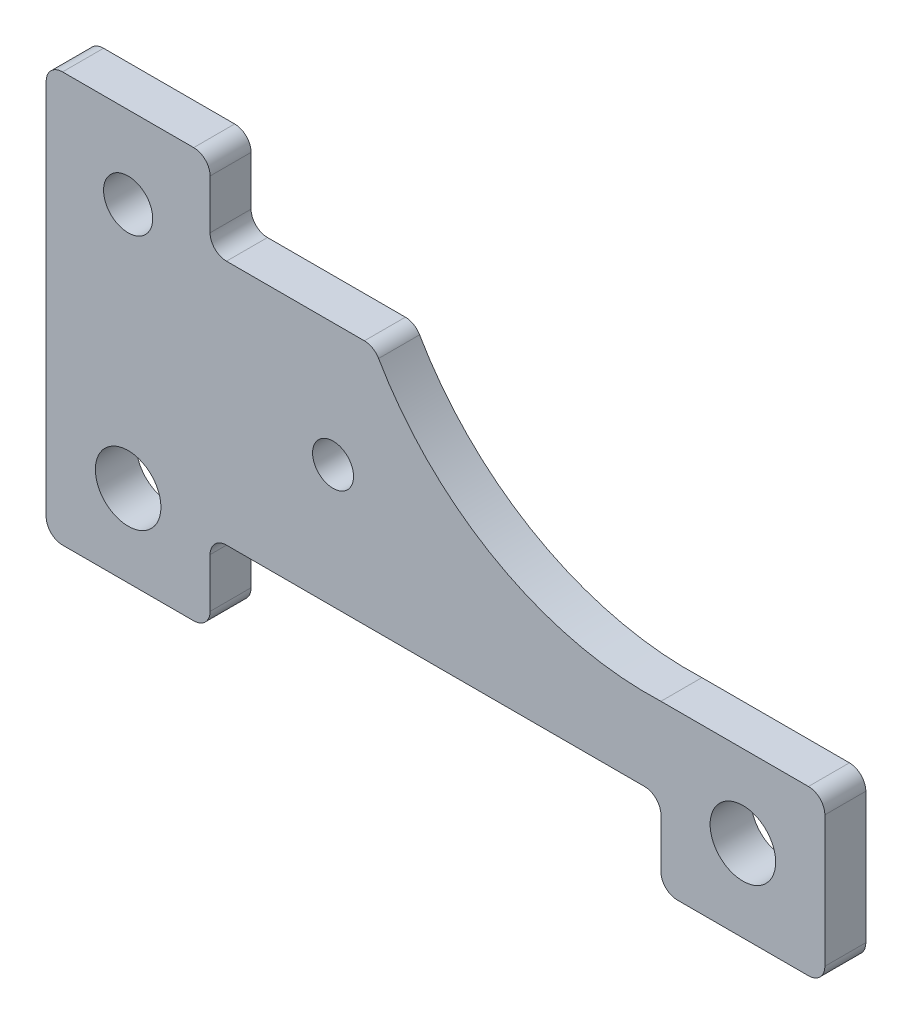
ISO-10303-21;
HEADER;
FILE_DESCRIPTION(('STEP AP214'),'2;1');
FILE_NAME('part.step','',(''),(''),'','','');
FILE_SCHEMA(('AUTOMOTIVE_DESIGN { 1 0 10303 214 1 1 1 1 }'));
ENDSEC;
DATA;
#1=APPLICATION_CONTEXT('core data for automotive mechanical design processes');
#2=APPLICATION_PROTOCOL_DEFINITION('international standard','automotive_design',2000,#1);
#3=PRODUCT_CONTEXT('',#1,'mechanical');
#4=PRODUCT('Part','Part','',(#3));
#5=PRODUCT_RELATED_PRODUCT_CATEGORY('part','',(#4));
#6=PRODUCT_DEFINITION_FORMATION('','',#4);
#7=PRODUCT_DEFINITION_CONTEXT('part definition',#1,'design');
#8=PRODUCT_DEFINITION('design','',#6,#7);
#9=PRODUCT_DEFINITION_SHAPE('','',#8);
#10=(LENGTH_UNIT() NAMED_UNIT(*) SI_UNIT(.MILLI.,.METRE.));
#11=(NAMED_UNIT(*) PLANE_ANGLE_UNIT() SI_UNIT($,.RADIAN.));
#12=(NAMED_UNIT(*) SI_UNIT($,.STERADIAN.) SOLID_ANGLE_UNIT());
#13=UNCERTAINTY_MEASURE_WITH_UNIT(LENGTH_MEASURE(1.E-05),#10,'distance_accuracy_value','');
#14=(GEOMETRIC_REPRESENTATION_CONTEXT(3) GLOBAL_UNCERTAINTY_ASSIGNED_CONTEXT((#13)) GLOBAL_UNIT_ASSIGNED_CONTEXT((#10,
#11,#12)) REPRESENTATION_CONTEXT('',''));
#15=CARTESIAN_POINT('',(0.,0.,0.));
#16=DIRECTION('',(0.,0.,1.));
#17=DIRECTION('',(1.,0.,0.));
#18=AXIS2_PLACEMENT_3D('',#15,#16,#17);
#19=CARTESIAN_POINT('',(180.,20.,25.));
#20=DIRECTION('',(0.,0.,-1.));
#21=DIRECTION('',(-1.,0.,0.));
#22=AXIS2_PLACEMENT_3D('',#19,#20,#21);
#23=PLANE('',#22);
#24=CARTESIAN_POINT('',(180.,20.,25.));
#25=DIRECTION('',(0.,0.,1.));
#26=DIRECTION('',(-1.,0.,0.));
#27=AXIS2_PLACEMENT_3D('',#24,#25,#26);
#28=CIRCLE('',#27,20.);
#29=CARTESIAN_POINT('',(180.,0.,25.));
#30=VERTEX_POINT('',#29);
#31=CARTESIAN_POINT('',(200.,20.,25.));
#32=VERTEX_POINT('',#31);
#33=EDGE_CURVE('E303',#30,#32,#28,.T.);
#34=ORIENTED_EDGE('',*,*,#33,.T.);
#35=DIRECTION('',(0.,1.,0.));
#36=VECTOR('',#35,1.);
#37=CARTESIAN_POINT('',(200.,79.9999999999999,25.));
#38=LINE('',#37,#36);
#39=CARTESIAN_POINT('',(200.,79.9999999999999,25.));
#40=VERTEX_POINT('',#39);
#41=EDGE_CURVE('E149',#32,#40,#38,.T.);
#42=ORIENTED_EDGE('',*,*,#41,.T.);
#43=CARTESIAN_POINT('',(220.,79.9999999999999,25.));
#44=DIRECTION('',(0.,0.,-1.));
#45=DIRECTION('',(1.,0.,0.));
#46=AXIS2_PLACEMENT_3D('',#43,#44,#45);
#47=CIRCLE('',#46,20.);
#48=CARTESIAN_POINT('',(220.,99.9999999999999,25.));
#49=VERTEX_POINT('',#48);
#50=EDGE_CURVE('E384',#40,#49,#47,.T.);
#51=ORIENTED_EDGE('',*,*,#50,.T.);
#52=DIRECTION('',(1.,0.,0.));
#53=VECTOR('',#52,1.);
#54=CARTESIAN_POINT('',(730.,100.,25.));
#55=LINE('',#54,#53);
#56=CARTESIAN_POINT('',(730.,100.,25.));
#57=VERTEX_POINT('',#56);
#58=EDGE_CURVE('E404',#49,#57,#55,.T.);
#59=ORIENTED_EDGE('',*,*,#58,.T.);
#60=CARTESIAN_POINT('',(730.,80.,25.));
#61=DIRECTION('',(0.,0.,-1.));
#62=DIRECTION('',(1.,0.,0.));
#63=AXIS2_PLACEMENT_3D('',#60,#61,#62);
#64=CIRCLE('',#63,19.9999999999999);
#65=CARTESIAN_POINT('',(750.,80.,25.));
#66=VERTEX_POINT('',#65);
#67=EDGE_CURVE('E400',#57,#66,#64,.T.);
#68=ORIENTED_EDGE('',*,*,#67,.T.);
#69=DIRECTION('',(0.,-1.,0.));
#70=VECTOR('',#69,1.);
#71=CARTESIAN_POINT('',(750.,20.0000000000001,25.));
#72=LINE('',#71,#70);
#73=CARTESIAN_POINT('',(750.,20.0000000000001,25.));
#74=VERTEX_POINT('',#73);
#75=EDGE_CURVE('E403',#66,#74,#72,.T.);
#76=ORIENTED_EDGE('',*,*,#75,.T.);
#77=CARTESIAN_POINT('',(770.,20.,25.));
#78=DIRECTION('',(0.,0.,1.));
#79=DIRECTION('',(1.,0.,0.));
#80=AXIS2_PLACEMENT_3D('',#77,#78,#79);
#81=CIRCLE('',#80,20.);
#82=CARTESIAN_POINT('',(770.,0.,25.));
#83=VERTEX_POINT('',#82);
#84=EDGE_CURVE('E408',#74,#83,#81,.T.);
#85=ORIENTED_EDGE('',*,*,#84,.T.);
#86=DIRECTION('',(1.,0.,0.));
#87=VECTOR('',#86,1.);
#88=CARTESIAN_POINT('',(770.,0.,25.));
#89=LINE('',#88,#87);
#90=CARTESIAN_POINT('',(930.,0.,25.));
#91=VERTEX_POINT('',#90);
#92=EDGE_CURVE('E415',#83,#91,#89,.T.);
#93=ORIENTED_EDGE('',*,*,#92,.T.);
#94=CARTESIAN_POINT('',(930.,20.,25.));
#95=DIRECTION('',(0.,0.,1.));
#96=DIRECTION('',(1.,0.,0.));
#97=AXIS2_PLACEMENT_3D('',#94,#95,#96);
#98=CIRCLE('',#97,20.);
#99=CARTESIAN_POINT('',(950.,20.,25.));
#100=VERTEX_POINT('',#99);
#101=EDGE_CURVE('E418',#91,#100,#98,.T.);
#102=ORIENTED_EDGE('',*,*,#101,.T.);
#103=DIRECTION('',(0.,1.,0.));
#104=VECTOR('',#103,1.);
#105=CARTESIAN_POINT('',(950.,20.0000000000001,25.));
#106=LINE('',#105,#104);
#107=CARTESIAN_POINT('',(950.,180.,25.));
#108=VERTEX_POINT('',#107);
#109=EDGE_CURVE('E421',#100,#108,#106,.T.);
#110=ORIENTED_EDGE('',*,*,#109,.T.);
#111=CARTESIAN_POINT('',(930.,180.,25.));
#112=DIRECTION('',(0.,0.,1.));
#113=DIRECTION('',(-1.,0.,0.));
#114=AXIS2_PLACEMENT_3D('',#111,#112,#113);
#115=CIRCLE('',#114,20.);
#116=CARTESIAN_POINT('',(930.,200.,25.));
#117=VERTEX_POINT('',#116);
#118=EDGE_CURVE('E424',#108,#117,#115,.T.);
#119=ORIENTED_EDGE('',*,*,#118,.T.);
#120=DIRECTION('',(-1.,0.,0.));
#121=VECTOR('',#120,1.);
#122=CARTESIAN_POINT('',(750.,200.,25.));
#123=LINE('',#122,#121);
#124=CARTESIAN_POINT('',(750.,200.,25.));
#125=VERTEX_POINT('',#124);
#126=EDGE_CURVE('E427',#117,#125,#123,.T.);
#127=ORIENTED_EDGE('',*,*,#126,.T.);
#128=CARTESIAN_POINT('',(734.826829364207,579.696951387362,25.));
#129=DIRECTION('',(0.,0.,-1.));
#130=DIRECTION('',(1.,0.,0.));
#131=AXIS2_PLACEMENT_3D('',#128,#129,#130);
#132=CIRCLE('',#131,380.);
#133=CARTESIAN_POINT('',(405.571126809262,389.984847569368,25.));
#134=VERTEX_POINT('',#133);
#135=EDGE_CURVE('E430',#125,#134,#132,.T.);
#136=ORIENTED_EDGE('',*,*,#135,.T.);
#137=CARTESIAN_POINT('',(388.24187930637,380.,25.));
#138=DIRECTION('',(0.,0.,1.));
#139=DIRECTION('',(-1.,0.,0.));
#140=AXIS2_PLACEMENT_3D('',#137,#138,#139);
#141=CIRCLE('',#140,20.);
#142=CARTESIAN_POINT('',(388.24187930637,400.,25.));
#143=VERTEX_POINT('',#142);
#144=EDGE_CURVE('E433',#134,#143,#141,.T.);
#145=ORIENTED_EDGE('',*,*,#144,.T.);
#146=DIRECTION('',(-1.,0.,0.));
#147=VECTOR('',#146,1.);
#148=CARTESIAN_POINT('',(220.,400.,25.));
#149=LINE('',#148,#147);
#150=CARTESIAN_POINT('',(220.,400.,25.));
#151=VERTEX_POINT('',#150);
#152=EDGE_CURVE('E436',#143,#151,#149,.T.);
#153=ORIENTED_EDGE('',*,*,#152,.T.);
#154=CARTESIAN_POINT('',(220.,420.,25.));
#155=DIRECTION('',(0.,0.,-1.));
#156=DIRECTION('',(1.,0.,0.));
#157=AXIS2_PLACEMENT_3D('',#154,#155,#156);
#158=CIRCLE('',#157,20.0000000000001);
#159=CARTESIAN_POINT('',(200.,420.,25.));
#160=VERTEX_POINT('',#159);
#161=EDGE_CURVE('E439',#151,#160,#158,.T.);
#162=ORIENTED_EDGE('',*,*,#161,.T.);
#163=DIRECTION('',(0.,1.,0.));
#164=VECTOR('',#163,1.);
#165=CARTESIAN_POINT('',(200.,480.,25.));
#166=LINE('',#165,#164);
#167=CARTESIAN_POINT('',(200.,480.,25.));
#168=VERTEX_POINT('',#167);
#169=EDGE_CURVE('E442',#160,#168,#166,.T.);
#170=ORIENTED_EDGE('',*,*,#169,.T.);
#171=CARTESIAN_POINT('',(180.,480.,25.));
#172=DIRECTION('',(0.,0.,1.));
#173=DIRECTION('',(1.,0.,0.));
#174=AXIS2_PLACEMENT_3D('',#171,#172,#173);
#175=CIRCLE('',#174,19.9999999999999);
#176=CARTESIAN_POINT('',(180.,500.,25.));
#177=VERTEX_POINT('',#176);
#178=EDGE_CURVE('E445',#168,#177,#175,.T.);
#179=ORIENTED_EDGE('',*,*,#178,.T.);
#180=DIRECTION('',(-1.,0.,0.));
#181=VECTOR('',#180,1.);
#182=CARTESIAN_POINT('',(20.0000000000001,500.,25.));
#183=LINE('',#182,#181);
#184=CARTESIAN_POINT('',(20.0000000000001,500.,25.));
#185=VERTEX_POINT('',#184);
#186=EDGE_CURVE('E448',#177,#185,#183,.T.);
#187=ORIENTED_EDGE('',*,*,#186,.T.);
#188=CARTESIAN_POINT('',(20.,480.,25.));
#189=DIRECTION('',(0.,0.,1.));
#190=DIRECTION('',(-1.,0.,0.));
#191=AXIS2_PLACEMENT_3D('',#188,#189,#190);
#192=CIRCLE('',#191,20.);
#193=CARTESIAN_POINT('',(0.,480.,25.));
#194=VERTEX_POINT('',#193);
#195=EDGE_CURVE('E213',#185,#194,#192,.T.);
#196=ORIENTED_EDGE('',*,*,#195,.T.);
#197=DIRECTION('',(0.,-1.,0.));
#198=VECTOR('',#197,1.);
#199=CARTESIAN_POINT('',(0.,20.0000000000001,25.));
#200=LINE('',#199,#198);
#201=CARTESIAN_POINT('',(0.,20.0000000000001,25.));
#202=VERTEX_POINT('',#201);
#203=EDGE_CURVE('E207',#194,#202,#200,.T.);
#204=ORIENTED_EDGE('',*,*,#203,.T.);
#205=CARTESIAN_POINT('',(20.,20.,25.));
#206=DIRECTION('',(0.,0.,1.));
#207=DIRECTION('',(-1.,0.,0.));
#208=AXIS2_PLACEMENT_3D('',#205,#206,#207);
#209=CIRCLE('',#208,20.);
#210=CARTESIAN_POINT('',(20.0000000000001,0.,25.));
#211=VERTEX_POINT('',#210);
#212=EDGE_CURVE('E211',#202,#211,#209,.T.);
#213=ORIENTED_EDGE('',*,*,#212,.T.);
#214=DIRECTION('',(1.,0.,0.));
#215=VECTOR('',#214,1.);
#216=CARTESIAN_POINT('',(20.0000000000001,0.,25.));
#217=LINE('',#216,#215);
#218=EDGE_CURVE('E61',#211,#30,#217,.T.);
#219=ORIENTED_EDGE('',*,*,#218,.T.);
#220=EDGE_LOOP('',(#34,#42,#51,#59,#68,#76,#85,#93,#102,#110,#119,#127,#136,#145,#153,#162,#170,
#179,#187,#196,#204,#213,#219));
#221=FACE_BOUND('',#220,.T.);
#222=CARTESIAN_POINT('',(100.,400.,25.));
#223=DIRECTION('',(0.,0.,1.));
#224=DIRECTION('',(1.,0.,0.));
#225=AXIS2_PLACEMENT_3D('',#222,#223,#224);
#226=CIRCLE('',#225,30.);
#227=CARTESIAN_POINT('',(130.,400.,25.));
#228=VERTEX_POINT('',#227);
#229=EDGE_CURVE('E240',#228,#228,#226,.T.);
#230=ORIENTED_EDGE('',*,*,#229,.F.);
#231=EDGE_LOOP('',(#230));
#232=FACE_BOUND('',#231,.T.);
#233=CARTESIAN_POINT('',(100.,99.9999999999999,25.));
#234=DIRECTION('',(0.,0.,1.));
#235=DIRECTION('',(1.,0.,0.));
#236=AXIS2_PLACEMENT_3D('',#233,#234,#235);
#237=CIRCLE('',#236,40.);
#238=CARTESIAN_POINT('',(140.,99.9999999999999,25.));
#239=VERTEX_POINT('',#238);
#240=EDGE_CURVE('E518',#239,#239,#237,.T.);
#241=ORIENTED_EDGE('',*,*,#240,.F.);
#242=EDGE_LOOP('',(#241));
#243=FACE_BOUND('',#242,.T.);
#244=CARTESIAN_POINT('',(350.,250.,25.));
#245=DIRECTION('',(0.,0.,1.));
#246=DIRECTION('',(1.,0.,0.));
#247=AXIS2_PLACEMENT_3D('',#244,#245,#246);
#248=CIRCLE('',#247,25.);
#249=CARTESIAN_POINT('',(375.,250.,25.));
#250=VERTEX_POINT('',#249);
#251=EDGE_CURVE('E510',#250,#250,#248,.T.);
#252=ORIENTED_EDGE('',*,*,#251,.F.);
#253=EDGE_LOOP('',(#252));
#254=FACE_BOUND('',#253,.T.);
#255=CARTESIAN_POINT('',(850.,100.,25.));
#256=DIRECTION('',(0.,0.,1.));
#257=DIRECTION('',(1.,0.,0.));
#258=AXIS2_PLACEMENT_3D('',#255,#256,#257);
#259=CIRCLE('',#258,40.);
#260=CARTESIAN_POINT('',(890.,100.,25.));
#261=VERTEX_POINT('',#260);
#262=EDGE_CURVE('E499',#261,#261,#259,.T.);
#263=ORIENTED_EDGE('',*,*,#262,.F.);
#264=EDGE_LOOP('',(#263));
#265=FACE_BOUND('',#264,.T.);
#266=ADVANCED_FACE('F43',(#221,#232,#243,#254,#265),#23,.F.);
#267=CARTESIAN_POINT('',(180.,20.,-25.));
#268=DIRECTION('',(0.,0.,-1.));
#269=DIRECTION('',(-1.,0.,0.));
#270=AXIS2_PLACEMENT_3D('',#267,#268,#269);
#271=PLANE('',#270);
#272=CARTESIAN_POINT('',(350.,250.,-25.));
#273=DIRECTION('',(0.,0.,1.));
#274=DIRECTION('',(1.,0.,0.));
#275=AXIS2_PLACEMENT_3D('',#272,#273,#274);
#276=CIRCLE('',#275,25.);
#277=CARTESIAN_POINT('',(375.,250.,-25.));
#278=VERTEX_POINT('',#277);
#279=EDGE_CURVE('E507',#278,#278,#276,.T.);
#280=ORIENTED_EDGE('',*,*,#279,.T.);
#281=EDGE_LOOP('',(#280));
#282=FACE_BOUND('',#281,.T.);
#283=CARTESIAN_POINT('',(100.,400.,-25.));
#284=DIRECTION('',(0.,0.,1.));
#285=DIRECTION('',(1.,0.,0.));
#286=AXIS2_PLACEMENT_3D('',#283,#284,#285);
#287=CIRCLE('',#286,30.);
#288=CARTESIAN_POINT('',(130.,400.,-25.));
#289=VERTEX_POINT('',#288);
#290=EDGE_CURVE('E522',#289,#289,#287,.T.);
#291=ORIENTED_EDGE('',*,*,#290,.T.);
#292=EDGE_LOOP('',(#291));
#293=FACE_BOUND('',#292,.T.);
#294=CARTESIAN_POINT('',(180.,20.,-25.));
#295=DIRECTION('',(0.,0.,1.));
#296=DIRECTION('',(-1.,0.,0.));
#297=AXIS2_PLACEMENT_3D('',#294,#295,#296);
#298=CIRCLE('',#297,20.);
#299=CARTESIAN_POINT('',(180.,0.,-25.));
#300=VERTEX_POINT('',#299);
#301=CARTESIAN_POINT('',(200.,20.,-25.));
#302=VERTEX_POINT('',#301);
#303=EDGE_CURVE('E235',#300,#302,#298,.T.);
#304=ORIENTED_EDGE('',*,*,#303,.F.);
#305=DIRECTION('',(1.,0.,0.));
#306=VECTOR('',#305,1.);
#307=CARTESIAN_POINT('',(20.0000000000001,0.,-25.));
#308=LINE('',#307,#306);
#309=CARTESIAN_POINT('',(20.0000000000001,0.,-25.));
#310=VERTEX_POINT('',#309);
#311=EDGE_CURVE('E141',#310,#300,#308,.T.);
#312=ORIENTED_EDGE('',*,*,#311,.F.);
#313=CARTESIAN_POINT('',(20.,20.,-25.));
#314=DIRECTION('',(0.,0.,1.));
#315=DIRECTION('',(-1.,0.,0.));
#316=AXIS2_PLACEMENT_3D('',#313,#314,#315);
#317=CIRCLE('',#316,20.);
#318=CARTESIAN_POINT('',(0.,20.0000000000001,-25.));
#319=VERTEX_POINT('',#318);
#320=EDGE_CURVE('E135',#319,#310,#317,.T.);
#321=ORIENTED_EDGE('',*,*,#320,.F.);
#322=DIRECTION('',(0.,-1.,0.));
#323=VECTOR('',#322,1.);
#324=CARTESIAN_POINT('',(0.,20.0000000000001,-25.));
#325=LINE('',#324,#323);
#326=CARTESIAN_POINT('',(0.,480.,-25.));
#327=VERTEX_POINT('',#326);
#328=EDGE_CURVE('E222',#327,#319,#325,.T.);
#329=ORIENTED_EDGE('',*,*,#328,.F.);
#330=CARTESIAN_POINT('',(20.,480.,-25.));
#331=DIRECTION('',(0.,0.,1.));
#332=DIRECTION('',(-1.,0.,0.));
#333=AXIS2_PLACEMENT_3D('',#330,#331,#332);
#334=CIRCLE('',#333,20.);
#335=CARTESIAN_POINT('',(20.0000000000001,500.,-25.));
#336=VERTEX_POINT('',#335);
#337=EDGE_CURVE('E294',#336,#327,#334,.T.);
#338=ORIENTED_EDGE('',*,*,#337,.F.);
#339=DIRECTION('',(-1.,0.,0.));
#340=VECTOR('',#339,1.);
#341=CARTESIAN_POINT('',(20.0000000000001,500.,-25.));
#342=LINE('',#341,#340);
#343=CARTESIAN_POINT('',(180.,500.,-25.));
#344=VERTEX_POINT('',#343);
#345=EDGE_CURVE('E291',#344,#336,#342,.T.);
#346=ORIENTED_EDGE('',*,*,#345,.F.);
#347=CARTESIAN_POINT('',(180.,480.,-25.));
#348=DIRECTION('',(0.,0.,1.));
#349=DIRECTION('',(1.,0.,0.));
#350=AXIS2_PLACEMENT_3D('',#347,#348,#349);
#351=CIRCLE('',#350,19.9999999999999);
#352=CARTESIAN_POINT('',(200.,480.,-25.));
#353=VERTEX_POINT('',#352);
#354=EDGE_CURVE('E288',#353,#344,#351,.T.);
#355=ORIENTED_EDGE('',*,*,#354,.F.);
#356=DIRECTION('',(0.,1.,0.));
#357=VECTOR('',#356,1.);
#358=CARTESIAN_POINT('',(200.,480.,-25.));
#359=LINE('',#358,#357);
#360=CARTESIAN_POINT('',(200.,420.,-25.));
#361=VERTEX_POINT('',#360);
#362=EDGE_CURVE('E285',#361,#353,#359,.T.);
#363=ORIENTED_EDGE('',*,*,#362,.F.);
#364=CARTESIAN_POINT('',(220.,420.,-25.));
#365=DIRECTION('',(0.,0.,-1.));
#366=DIRECTION('',(1.,0.,0.));
#367=AXIS2_PLACEMENT_3D('',#364,#365,#366);
#368=CIRCLE('',#367,20.0000000000001);
#369=CARTESIAN_POINT('',(220.,400.,-25.));
#370=VERTEX_POINT('',#369);
#371=EDGE_CURVE('E282',#370,#361,#368,.T.);
#372=ORIENTED_EDGE('',*,*,#371,.F.);
#373=DIRECTION('',(-1.,0.,0.));
#374=VECTOR('',#373,1.);
#375=CARTESIAN_POINT('',(220.,400.,-25.));
#376=LINE('',#375,#374);
#377=CARTESIAN_POINT('',(388.24187930637,400.,-25.));
#378=VERTEX_POINT('',#377);
#379=EDGE_CURVE('E279',#378,#370,#376,.T.);
#380=ORIENTED_EDGE('',*,*,#379,.F.);
#381=CARTESIAN_POINT('',(388.24187930637,380.,-25.));
#382=DIRECTION('',(0.,0.,1.));
#383=DIRECTION('',(-1.,0.,0.));
#384=AXIS2_PLACEMENT_3D('',#381,#382,#383);
#385=CIRCLE('',#384,20.);
#386=CARTESIAN_POINT('',(405.571126809262,389.984847569368,-25.));
#387=VERTEX_POINT('',#386);
#388=EDGE_CURVE('E276',#387,#378,#385,.T.);
#389=ORIENTED_EDGE('',*,*,#388,.F.);
#390=CARTESIAN_POINT('',(734.826829364207,579.696951387362,-25.));
#391=DIRECTION('',(0.,0.,-1.));
#392=DIRECTION('',(1.,0.,0.));
#393=AXIS2_PLACEMENT_3D('',#390,#391,#392);
#394=CIRCLE('',#393,380.);
#395=CARTESIAN_POINT('',(750.,200.,-25.));
#396=VERTEX_POINT('',#395);
#397=EDGE_CURVE('E273',#396,#387,#394,.T.);
#398=ORIENTED_EDGE('',*,*,#397,.F.);
#399=DIRECTION('',(-1.,0.,0.));
#400=VECTOR('',#399,1.);
#401=CARTESIAN_POINT('',(750.,200.,-25.));
#402=LINE('',#401,#400);
#403=CARTESIAN_POINT('',(930.,200.,-25.));
#404=VERTEX_POINT('',#403);
#405=EDGE_CURVE('E270',#404,#396,#402,.T.);
#406=ORIENTED_EDGE('',*,*,#405,.F.);
#407=CARTESIAN_POINT('',(930.,180.,-25.));
#408=DIRECTION('',(0.,0.,1.));
#409=DIRECTION('',(-1.,0.,0.));
#410=AXIS2_PLACEMENT_3D('',#407,#408,#409);
#411=CIRCLE('',#410,20.);
#412=CARTESIAN_POINT('',(950.,180.,-25.));
#413=VERTEX_POINT('',#412);
#414=EDGE_CURVE('E267',#413,#404,#411,.T.);
#415=ORIENTED_EDGE('',*,*,#414,.F.);
#416=DIRECTION('',(0.,1.,0.));
#417=VECTOR('',#416,1.);
#418=CARTESIAN_POINT('',(950.,20.0000000000001,-25.));
#419=LINE('',#418,#417);
#420=CARTESIAN_POINT('',(950.,20.,-25.));
#421=VERTEX_POINT('',#420);
#422=EDGE_CURVE('E264',#421,#413,#419,.T.);
#423=ORIENTED_EDGE('',*,*,#422,.F.);
#424=CARTESIAN_POINT('',(930.,20.,-25.));
#425=DIRECTION('',(0.,0.,1.));
#426=DIRECTION('',(1.,0.,0.));
#427=AXIS2_PLACEMENT_3D('',#424,#425,#426);
#428=CIRCLE('',#427,20.);
#429=CARTESIAN_POINT('',(930.,0.,-25.));
#430=VERTEX_POINT('',#429);
#431=EDGE_CURVE('E261',#430,#421,#428,.T.);
#432=ORIENTED_EDGE('',*,*,#431,.F.);
#433=DIRECTION('',(1.,0.,0.));
#434=VECTOR('',#433,1.);
#435=CARTESIAN_POINT('',(770.,0.,-25.));
#436=LINE('',#435,#434);
#437=CARTESIAN_POINT('',(770.,0.,-25.));
#438=VERTEX_POINT('',#437);
#439=EDGE_CURVE('E258',#438,#430,#436,.T.);
#440=ORIENTED_EDGE('',*,*,#439,.F.);
#441=CARTESIAN_POINT('',(770.,20.,-25.));
#442=DIRECTION('',(0.,0.,1.));
#443=DIRECTION('',(1.,0.,0.));
#444=AXIS2_PLACEMENT_3D('',#441,#442,#443);
#445=CIRCLE('',#444,20.);
#446=CARTESIAN_POINT('',(750.,20.0000000000001,-25.));
#447=VERTEX_POINT('',#446);
#448=EDGE_CURVE('E255',#447,#438,#445,.T.);
#449=ORIENTED_EDGE('',*,*,#448,.F.);
#450=DIRECTION('',(0.,-1.,0.));
#451=VECTOR('',#450,1.);
#452=CARTESIAN_POINT('',(750.,20.0000000000001,-25.));
#453=LINE('',#452,#451);
#454=CARTESIAN_POINT('',(750.,80.,-25.));
#455=VERTEX_POINT('',#454);
#456=EDGE_CURVE('E252',#455,#447,#453,.T.);
#457=ORIENTED_EDGE('',*,*,#456,.F.);
#458=CARTESIAN_POINT('',(730.,80.,-25.));
#459=DIRECTION('',(0.,0.,-1.));
#460=DIRECTION('',(1.,0.,0.));
#461=AXIS2_PLACEMENT_3D('',#458,#459,#460);
#462=CIRCLE('',#461,19.9999999999999);
#463=CARTESIAN_POINT('',(730.,100.,-25.));
#464=VERTEX_POINT('',#463);
#465=EDGE_CURVE('E249',#464,#455,#462,.T.);
#466=ORIENTED_EDGE('',*,*,#465,.F.);
#467=DIRECTION('',(1.,0.,0.));
#468=VECTOR('',#467,1.);
#469=CARTESIAN_POINT('',(730.,100.,-25.));
#470=LINE('',#469,#468);
#471=CARTESIAN_POINT('',(220.,99.9999999999999,-25.));
#472=VERTEX_POINT('',#471);
#473=EDGE_CURVE('E246',#472,#464,#470,.T.);
#474=ORIENTED_EDGE('',*,*,#473,.F.);
#475=CARTESIAN_POINT('',(220.,79.9999999999999,-25.));
#476=DIRECTION('',(0.,0.,-1.));
#477=DIRECTION('',(1.,0.,0.));
#478=AXIS2_PLACEMENT_3D('',#475,#476,#477);
#479=CIRCLE('',#478,20.);
#480=CARTESIAN_POINT('',(200.,79.9999999999999,-25.));
#481=VERTEX_POINT('',#480);
#482=EDGE_CURVE('E243',#481,#472,#479,.T.);
#483=ORIENTED_EDGE('',*,*,#482,.F.);
#484=DIRECTION('',(0.,1.,0.));
#485=VECTOR('',#484,1.);
#486=CARTESIAN_POINT('',(200.,79.9999999999999,-25.));
#487=LINE('',#486,#485);
#488=EDGE_CURVE('E239',#302,#481,#487,.T.);
#489=ORIENTED_EDGE('',*,*,#488,.F.);
#490=EDGE_LOOP('',(#304,#312,#321,#329,#338,#346,#355,#363,#372,#380,#389,#398,#406,#415,#423,
#432,#440,#449,#457,#466,#474,#483,#489));
#491=FACE_BOUND('',#490,.T.);
#492=CARTESIAN_POINT('',(100.,99.9999999999999,-25.));
#493=DIRECTION('',(0.,0.,1.));
#494=DIRECTION('',(1.,0.,0.));
#495=AXIS2_PLACEMENT_3D('',#492,#493,#494);
#496=CIRCLE('',#495,40.);
#497=CARTESIAN_POINT('',(140.,99.9999999999999,-25.));
#498=VERTEX_POINT('',#497);
#499=EDGE_CURVE('E514',#498,#498,#496,.T.);
#500=ORIENTED_EDGE('',*,*,#499,.T.);
#501=EDGE_LOOP('',(#500));
#502=FACE_BOUND('',#501,.T.);
#503=CARTESIAN_POINT('',(850.,100.,-25.));
#504=DIRECTION('',(0.,0.,1.));
#505=DIRECTION('',(1.,0.,0.));
#506=AXIS2_PLACEMENT_3D('',#503,#504,#505);
#507=CIRCLE('',#506,40.);
#508=CARTESIAN_POINT('',(890.,100.,-25.));
#509=VERTEX_POINT('',#508);
#510=EDGE_CURVE('E502',#509,#509,#507,.T.);
#511=ORIENTED_EDGE('',*,*,#510,.T.);
#512=EDGE_LOOP('',(#511));
#513=FACE_BOUND('',#512,.T.);
#514=ADVANCED_FACE('F388',(#282,#293,#491,#502,#513),#271,.T.);
#515=CARTESIAN_POINT('',(180.,20.,25.));
#516=DIRECTION('',(0.,0.,-1.));
#517=DIRECTION('',(-1.,0.,0.));
#518=AXIS2_PLACEMENT_3D('',#515,#516,#517);
#519=CYLINDRICAL_SURFACE('',#518,20.);
#520=ORIENTED_EDGE('',*,*,#303,.T.);
#521=DIRECTION('',(0.,0.,-1.));
#522=VECTOR('',#521,1.);
#523=CARTESIAN_POINT('',(200.,20.,25.));
#524=LINE('',#523,#522);
#525=EDGE_CURVE('E11',#32,#302,#524,.T.);
#526=ORIENTED_EDGE('',*,*,#525,.F.);
#527=ORIENTED_EDGE('',*,*,#33,.F.);
#528=DIRECTION('',(0.,0.,-1.));
#529=VECTOR('',#528,1.);
#530=CARTESIAN_POINT('',(180.,0.,25.));
#531=LINE('',#530,#529);
#532=EDGE_CURVE('E231',#30,#300,#531,.T.);
#533=ORIENTED_EDGE('',*,*,#532,.T.);
#534=EDGE_LOOP('',(#520,#526,#527,#533));
#535=FACE_BOUND('',#534,.T.);
#536=ADVANCED_FACE('F45',(#535),#519,.T.);
#537=CARTESIAN_POINT('',(200.,79.9999999999999,25.));
#538=DIRECTION('',(-1.,0.,0.));
#539=DIRECTION('',(0.,-1.,0.));
#540=AXIS2_PLACEMENT_3D('',#537,#538,#539);
#541=PLANE('',#540);
#542=ORIENTED_EDGE('',*,*,#488,.T.);
#543=DIRECTION('',(0.,0.,-1.));
#544=VECTOR('',#543,1.);
#545=CARTESIAN_POINT('',(200.,79.9999999999999,25.));
#546=LINE('',#545,#544);
#547=EDGE_CURVE('E53',#40,#481,#546,.T.);
#548=ORIENTED_EDGE('',*,*,#547,.F.);
#549=ORIENTED_EDGE('',*,*,#41,.F.);
#550=ORIENTED_EDGE('',*,*,#525,.T.);
#551=EDGE_LOOP('',(#542,#548,#549,#550));
#552=FACE_BOUND('',#551,.T.);
#553=ADVANCED_FACE('F771',(#552),#541,.F.);
#554=CARTESIAN_POINT('',(220.,79.9999999999999,25.));
#555=DIRECTION('',(0.,0.,-1.));
#556=DIRECTION('',(-1.,0.,0.));
#557=AXIS2_PLACEMENT_3D('',#554,#555,#556);
#558=CYLINDRICAL_SURFACE('',#557,20.);
#559=ORIENTED_EDGE('',*,*,#482,.T.);
#560=DIRECTION('',(0.,0.,-1.));
#561=VECTOR('',#560,1.);
#562=CARTESIAN_POINT('',(220.,99.9999999999999,25.));
#563=LINE('',#562,#561);
#564=EDGE_CURVE('E374',#49,#472,#563,.T.);
#565=ORIENTED_EDGE('',*,*,#564,.F.);
#566=ORIENTED_EDGE('',*,*,#50,.F.);
#567=ORIENTED_EDGE('',*,*,#547,.T.);
#568=EDGE_LOOP('',(#559,#565,#566,#567));
#569=FACE_BOUND('',#568,.T.);
#570=ADVANCED_FACE('F382',(#569),#558,.F.);
#571=CARTESIAN_POINT('',(730.,100.,25.));
#572=DIRECTION('',(0.,1.,0.));
#573=DIRECTION('',(-1.,0.,0.));
#574=AXIS2_PLACEMENT_3D('',#571,#572,#573);
#575=PLANE('',#574);
#576=ORIENTED_EDGE('',*,*,#473,.T.);
#577=DIRECTION('',(0.,0.,-1.));
#578=VECTOR('',#577,1.);
#579=CARTESIAN_POINT('',(730.,100.,25.));
#580=LINE('',#579,#578);
#581=EDGE_CURVE('E370',#57,#464,#580,.T.);
#582=ORIENTED_EDGE('',*,*,#581,.F.);
#583=ORIENTED_EDGE('',*,*,#58,.F.);
#584=ORIENTED_EDGE('',*,*,#564,.T.);
#585=EDGE_LOOP('',(#576,#582,#583,#584));
#586=FACE_BOUND('',#585,.T.);
#587=ADVANCED_FACE('F394',(#586),#575,.F.);
#588=CARTESIAN_POINT('',(730.,80.,25.));
#589=DIRECTION('',(0.,0.,-1.));
#590=DIRECTION('',(-1.,0.,0.));
#591=AXIS2_PLACEMENT_3D('',#588,#589,#590);
#592=CYLINDRICAL_SURFACE('',#591,19.9999999999999);
#593=ORIENTED_EDGE('',*,*,#465,.T.);
#594=DIRECTION('',(0.,0.,-1.));
#595=VECTOR('',#594,1.);
#596=CARTESIAN_POINT('',(750.,80.,25.));
#597=LINE('',#596,#595);
#598=EDGE_CURVE('E366',#66,#455,#597,.T.);
#599=ORIENTED_EDGE('',*,*,#598,.F.);
#600=ORIENTED_EDGE('',*,*,#67,.F.);
#601=ORIENTED_EDGE('',*,*,#581,.T.);
#602=EDGE_LOOP('',(#593,#599,#600,#601));
#603=FACE_BOUND('',#602,.T.);
#604=ADVANCED_FACE('F398',(#603),#592,.F.);
#605=CARTESIAN_POINT('',(750.,20.0000000000001,25.));
#606=DIRECTION('',(1.,0.,0.));
#607=DIRECTION('',(0.,1.,0.));
#608=AXIS2_PLACEMENT_3D('',#605,#606,#607);
#609=PLANE('',#608);
#610=ORIENTED_EDGE('',*,*,#456,.T.);
#611=DIRECTION('',(0.,0.,-1.));
#612=VECTOR('',#611,1.);
#613=CARTESIAN_POINT('',(750.,20.0000000000001,25.));
#614=LINE('',#613,#612);
#615=EDGE_CURVE('E362',#74,#447,#614,.T.);
#616=ORIENTED_EDGE('',*,*,#615,.F.);
#617=ORIENTED_EDGE('',*,*,#75,.F.);
#618=ORIENTED_EDGE('',*,*,#598,.T.);
#619=EDGE_LOOP('',(#610,#616,#617,#618));
#620=FACE_BOUND('',#619,.T.);
#621=ADVANCED_FACE('F732',(#620),#609,.F.);
#622=CARTESIAN_POINT('',(770.,20.,25.));
#623=DIRECTION('',(0.,0.,-1.));
#624=DIRECTION('',(-1.,0.,0.));
#625=AXIS2_PLACEMENT_3D('',#622,#623,#624);
#626=CYLINDRICAL_SURFACE('',#625,20.);
#627=ORIENTED_EDGE('',*,*,#448,.T.);
#628=DIRECTION('',(0.,0.,-1.));
#629=VECTOR('',#628,1.);
#630=CARTESIAN_POINT('',(770.,0.,25.));
#631=LINE('',#630,#629);
#632=EDGE_CURVE('E358',#83,#438,#631,.T.);
#633=ORIENTED_EDGE('',*,*,#632,.F.);
#634=ORIENTED_EDGE('',*,*,#84,.F.);
#635=ORIENTED_EDGE('',*,*,#615,.T.);
#636=EDGE_LOOP('',(#627,#633,#634,#635));
#637=FACE_BOUND('',#636,.T.);
#638=ADVANCED_FACE('F721',(#637),#626,.T.);
#639=CARTESIAN_POINT('',(770.,0.,25.));
#640=DIRECTION('',(0.,1.,0.));
#641=DIRECTION('',(0.,0.,1.));
#642=AXIS2_PLACEMENT_3D('',#639,#640,#641);
#643=PLANE('',#642);
#644=ORIENTED_EDGE('',*,*,#439,.T.);
#645=DIRECTION('',(0.,0.,-1.));
#646=VECTOR('',#645,1.);
#647=CARTESIAN_POINT('',(930.,0.,25.));
#648=LINE('',#647,#646);
#649=EDGE_CURVE('E354',#91,#430,#648,.T.);
#650=ORIENTED_EDGE('',*,*,#649,.F.);
#651=ORIENTED_EDGE('',*,*,#92,.F.);
#652=ORIENTED_EDGE('',*,*,#632,.T.);
#653=EDGE_LOOP('',(#644,#650,#651,#652));
#654=FACE_BOUND('',#653,.T.);
#655=ADVANCED_FACE('F710',(#654),#643,.F.);
#656=CARTESIAN_POINT('',(930.,20.,25.));
#657=DIRECTION('',(0.,0.,-1.));
#658=DIRECTION('',(-1.,0.,0.));
#659=AXIS2_PLACEMENT_3D('',#656,#657,#658);
#660=CYLINDRICAL_SURFACE('',#659,20.);
#661=ORIENTED_EDGE('',*,*,#431,.T.);
#662=DIRECTION('',(0.,0.,-1.));
#663=VECTOR('',#662,1.);
#664=CARTESIAN_POINT('',(950.,20.,25.));
#665=LINE('',#664,#663);
#666=EDGE_CURVE('E350',#100,#421,#665,.T.);
#667=ORIENTED_EDGE('',*,*,#666,.F.);
#668=ORIENTED_EDGE('',*,*,#101,.F.);
#669=ORIENTED_EDGE('',*,*,#649,.T.);
#670=EDGE_LOOP('',(#661,#667,#668,#669));
#671=FACE_BOUND('',#670,.T.);
#672=ADVANCED_FACE('F699',(#671),#660,.T.);
#673=CARTESIAN_POINT('',(950.,20.0000000000001,25.));
#674=DIRECTION('',(-1.,0.,0.));
#675=DIRECTION('',(0.,0.,1.));
#676=AXIS2_PLACEMENT_3D('',#673,#674,#675);
#677=PLANE('',#676);
#678=ORIENTED_EDGE('',*,*,#422,.T.);
#679=DIRECTION('',(0.,0.,-1.));
#680=VECTOR('',#679,1.);
#681=CARTESIAN_POINT('',(950.,180.,25.));
#682=LINE('',#681,#680);
#683=EDGE_CURVE('E346',#108,#413,#682,.T.);
#684=ORIENTED_EDGE('',*,*,#683,.F.);
#685=ORIENTED_EDGE('',*,*,#109,.F.);
#686=ORIENTED_EDGE('',*,*,#666,.T.);
#687=EDGE_LOOP('',(#678,#684,#685,#686));
#688=FACE_BOUND('',#687,.T.);
#689=ADVANCED_FACE('F688',(#688),#677,.F.);
#690=CARTESIAN_POINT('',(930.,180.,25.));
#691=DIRECTION('',(0.,0.,-1.));
#692=DIRECTION('',(-1.,0.,0.));
#693=AXIS2_PLACEMENT_3D('',#690,#691,#692);
#694=CYLINDRICAL_SURFACE('',#693,20.);
#695=ORIENTED_EDGE('',*,*,#414,.T.);
#696=DIRECTION('',(0.,0.,-1.));
#697=VECTOR('',#696,1.);
#698=CARTESIAN_POINT('',(930.,200.,25.));
#699=LINE('',#698,#697);
#700=EDGE_CURVE('E342',#117,#404,#699,.T.);
#701=ORIENTED_EDGE('',*,*,#700,.F.);
#702=ORIENTED_EDGE('',*,*,#118,.F.);
#703=ORIENTED_EDGE('',*,*,#683,.T.);
#704=EDGE_LOOP('',(#695,#701,#702,#703));
#705=FACE_BOUND('',#704,.T.);
#706=ADVANCED_FACE('F677',(#705),#694,.T.);
#707=CARTESIAN_POINT('',(750.,200.,25.));
#708=DIRECTION('',(0.,-1.,0.));
#709=DIRECTION('',(0.,0.,-1.));
#710=AXIS2_PLACEMENT_3D('',#707,#708,#709);
#711=PLANE('',#710);
#712=ORIENTED_EDGE('',*,*,#405,.T.);
#713=DIRECTION('',(0.,0.,-1.));
#714=VECTOR('',#713,1.);
#715=CARTESIAN_POINT('',(750.,200.,25.));
#716=LINE('',#715,#714);
#717=EDGE_CURVE('E338',#125,#396,#716,.T.);
#718=ORIENTED_EDGE('',*,*,#717,.F.);
#719=ORIENTED_EDGE('',*,*,#126,.F.);
#720=ORIENTED_EDGE('',*,*,#700,.T.);
#721=EDGE_LOOP('',(#712,#718,#719,#720));
#722=FACE_BOUND('',#721,.T.);
#723=ADVANCED_FACE('F666',(#722),#711,.F.);
#724=CARTESIAN_POINT('',(734.826829364207,579.696951387362,25.));
#725=DIRECTION('',(0.,0.,-1.));
#726=DIRECTION('',(-1.,0.,0.));
#727=AXIS2_PLACEMENT_3D('',#724,#725,#726);
#728=CYLINDRICAL_SURFACE('',#727,380.);
#729=ORIENTED_EDGE('',*,*,#397,.T.);
#730=DIRECTION('',(0.,0.,-1.));
#731=VECTOR('',#730,1.);
#732=CARTESIAN_POINT('',(405.571126809262,389.984847569368,25.));
#733=LINE('',#732,#731);
#734=EDGE_CURVE('E334',#134,#387,#733,.T.);
#735=ORIENTED_EDGE('',*,*,#734,.F.);
#736=ORIENTED_EDGE('',*,*,#135,.F.);
#737=ORIENTED_EDGE('',*,*,#717,.T.);
#738=EDGE_LOOP('',(#729,#735,#736,#737));
#739=FACE_BOUND('',#738,.T.);
#740=ADVANCED_FACE('F655',(#739),#728,.F.);
#741=CARTESIAN_POINT('',(388.24187930637,380.,25.));
#742=DIRECTION('',(0.,0.,-1.));
#743=DIRECTION('',(-1.,0.,0.));
#744=AXIS2_PLACEMENT_3D('',#741,#742,#743);
#745=CYLINDRICAL_SURFACE('',#744,20.);
#746=ORIENTED_EDGE('',*,*,#388,.T.);
#747=DIRECTION('',(0.,0.,-1.));
#748=VECTOR('',#747,1.);
#749=CARTESIAN_POINT('',(388.24187930637,400.,25.));
#750=LINE('',#749,#748);
#751=EDGE_CURVE('E330',#143,#378,#750,.T.);
#752=ORIENTED_EDGE('',*,*,#751,.F.);
#753=ORIENTED_EDGE('',*,*,#144,.F.);
#754=ORIENTED_EDGE('',*,*,#734,.T.);
#755=EDGE_LOOP('',(#746,#752,#753,#754));
#756=FACE_BOUND('',#755,.T.);
#757=ADVANCED_FACE('F644',(#756),#745,.T.);
#758=CARTESIAN_POINT('',(220.,400.,25.));
#759=DIRECTION('',(0.,-1.,0.));
#760=DIRECTION('',(1.,0.,0.));
#761=AXIS2_PLACEMENT_3D('',#758,#759,#760);
#762=PLANE('',#761);
#763=ORIENTED_EDGE('',*,*,#379,.T.);
#764=DIRECTION('',(0.,0.,-1.));
#765=VECTOR('',#764,1.);
#766=CARTESIAN_POINT('',(220.,400.,25.));
#767=LINE('',#766,#765);
#768=EDGE_CURVE('E326',#151,#370,#767,.T.);
#769=ORIENTED_EDGE('',*,*,#768,.F.);
#770=ORIENTED_EDGE('',*,*,#152,.F.);
#771=ORIENTED_EDGE('',*,*,#751,.T.);
#772=EDGE_LOOP('',(#763,#769,#770,#771));
#773=FACE_BOUND('',#772,.T.);
#774=ADVANCED_FACE('F633',(#773),#762,.F.);
#775=CARTESIAN_POINT('',(220.,420.,25.));
#776=DIRECTION('',(0.,0.,-1.));
#777=DIRECTION('',(-1.,0.,0.));
#778=AXIS2_PLACEMENT_3D('',#775,#776,#777);
#779=CYLINDRICAL_SURFACE('',#778,20.0000000000001);
#780=ORIENTED_EDGE('',*,*,#371,.T.);
#781=DIRECTION('',(0.,0.,-1.));
#782=VECTOR('',#781,1.);
#783=CARTESIAN_POINT('',(200.,420.,25.));
#784=LINE('',#783,#782);
#785=EDGE_CURVE('E322',#160,#361,#784,.T.);
#786=ORIENTED_EDGE('',*,*,#785,.F.);
#787=ORIENTED_EDGE('',*,*,#161,.F.);
#788=ORIENTED_EDGE('',*,*,#768,.T.);
#789=EDGE_LOOP('',(#780,#786,#787,#788));
#790=FACE_BOUND('',#789,.T.);
#791=ADVANCED_FACE('F622',(#790),#779,.F.);
#792=CARTESIAN_POINT('',(200.,480.,25.));
#793=DIRECTION('',(-1.,0.,0.));
#794=DIRECTION('',(0.,-1.,0.));
#795=AXIS2_PLACEMENT_3D('',#792,#793,#794);
#796=PLANE('',#795);
#797=ORIENTED_EDGE('',*,*,#362,.T.);
#798=DIRECTION('',(0.,0.,-1.));
#799=VECTOR('',#798,1.);
#800=CARTESIAN_POINT('',(200.,480.,25.));
#801=LINE('',#800,#799);
#802=EDGE_CURVE('E318',#168,#353,#801,.T.);
#803=ORIENTED_EDGE('',*,*,#802,.F.);
#804=ORIENTED_EDGE('',*,*,#169,.F.);
#805=ORIENTED_EDGE('',*,*,#785,.T.);
#806=EDGE_LOOP('',(#797,#803,#804,#805));
#807=FACE_BOUND('',#806,.T.);
#808=ADVANCED_FACE('F611',(#807),#796,.F.);
#809=CARTESIAN_POINT('',(180.,480.,25.));
#810=DIRECTION('',(0.,0.,-1.));
#811=DIRECTION('',(-1.,0.,0.));
#812=AXIS2_PLACEMENT_3D('',#809,#810,#811);
#813=CYLINDRICAL_SURFACE('',#812,19.9999999999999);
#814=ORIENTED_EDGE('',*,*,#354,.T.);
#815=DIRECTION('',(0.,0.,-1.));
#816=VECTOR('',#815,1.);
#817=CARTESIAN_POINT('',(180.,500.,25.));
#818=LINE('',#817,#816);
#819=EDGE_CURVE('E314',#177,#344,#818,.T.);
#820=ORIENTED_EDGE('',*,*,#819,.F.);
#821=ORIENTED_EDGE('',*,*,#178,.F.);
#822=ORIENTED_EDGE('',*,*,#802,.T.);
#823=EDGE_LOOP('',(#814,#820,#821,#822));
#824=FACE_BOUND('',#823,.T.);
#825=ADVANCED_FACE('F601',(#824),#813,.T.);
#826=CARTESIAN_POINT('',(20.0000000000001,500.,25.));
#827=DIRECTION('',(0.,-1.,0.));
#828=DIRECTION('',(1.,0.,0.));
#829=AXIS2_PLACEMENT_3D('',#826,#827,#828);
#830=PLANE('',#829);
#831=ORIENTED_EDGE('',*,*,#345,.T.);
#832=DIRECTION('',(0.,0.,-1.));
#833=VECTOR('',#832,1.);
#834=CARTESIAN_POINT('',(20.0000000000001,500.,25.));
#835=LINE('',#834,#833);
#836=EDGE_CURVE('E310',#185,#336,#835,.T.);
#837=ORIENTED_EDGE('',*,*,#836,.F.);
#838=ORIENTED_EDGE('',*,*,#186,.F.);
#839=ORIENTED_EDGE('',*,*,#819,.T.);
#840=EDGE_LOOP('',(#831,#837,#838,#839));
#841=FACE_BOUND('',#840,.T.);
#842=ADVANCED_FACE('F456',(#841),#830,.F.);
#843=CARTESIAN_POINT('',(20.,480.,25.));
#844=DIRECTION('',(0.,0.,-1.));
#845=DIRECTION('',(-1.,0.,0.));
#846=AXIS2_PLACEMENT_3D('',#843,#844,#845);
#847=CYLINDRICAL_SURFACE('',#846,20.);
#848=ORIENTED_EDGE('',*,*,#337,.T.);
#849=DIRECTION('',(0.,0.,-1.));
#850=VECTOR('',#849,1.);
#851=CARTESIAN_POINT('',(0.,480.,25.));
#852=LINE('',#851,#850);
#853=EDGE_CURVE('E224',#194,#327,#852,.T.);
#854=ORIENTED_EDGE('',*,*,#853,.F.);
#855=ORIENTED_EDGE('',*,*,#195,.F.);
#856=ORIENTED_EDGE('',*,*,#836,.T.);
#857=EDGE_LOOP('',(#848,#854,#855,#856));
#858=FACE_BOUND('',#857,.T.);
#859=ADVANCED_FACE('F460',(#858),#847,.T.);
#860=CARTESIAN_POINT('',(0.,20.0000000000001,25.));
#861=DIRECTION('',(1.,0.,0.));
#862=DIRECTION('',(0.,0.,-1.));
#863=AXIS2_PLACEMENT_3D('',#860,#861,#862);
#864=PLANE('',#863);
#865=ORIENTED_EDGE('',*,*,#328,.T.);
#866=DIRECTION('',(0.,0.,-1.));
#867=VECTOR('',#866,1.);
#868=CARTESIAN_POINT('',(0.,20.0000000000001,25.));
#869=LINE('',#868,#867);
#870=EDGE_CURVE('E219',#202,#319,#869,.T.);
#871=ORIENTED_EDGE('',*,*,#870,.F.);
#872=ORIENTED_EDGE('',*,*,#203,.F.);
#873=ORIENTED_EDGE('',*,*,#853,.T.);
#874=EDGE_LOOP('',(#865,#871,#872,#873));
#875=FACE_BOUND('',#874,.T.);
#876=ADVANCED_FACE('F220',(#875),#864,.F.);
#877=CARTESIAN_POINT('',(20.,20.,25.));
#878=DIRECTION('',(0.,0.,-1.));
#879=DIRECTION('',(-1.,0.,0.));
#880=AXIS2_PLACEMENT_3D('',#877,#878,#879);
#881=CYLINDRICAL_SURFACE('',#880,20.);
#882=ORIENTED_EDGE('',*,*,#320,.T.);
#883=DIRECTION('',(0.,0.,-1.));
#884=VECTOR('',#883,1.);
#885=CARTESIAN_POINT('',(20.0000000000001,0.,25.));
#886=LINE('',#885,#884);
#887=EDGE_CURVE('E225',#211,#310,#886,.T.);
#888=ORIENTED_EDGE('',*,*,#887,.F.);
#889=ORIENTED_EDGE('',*,*,#212,.F.);
#890=ORIENTED_EDGE('',*,*,#870,.T.);
#891=EDGE_LOOP('',(#882,#888,#889,#890));
#892=FACE_BOUND('',#891,.T.);
#893=ADVANCED_FACE('F227',(#892),#881,.T.);
#894=CARTESIAN_POINT('',(20.0000000000001,0.,25.));
#895=DIRECTION('',(0.,1.,0.));
#896=DIRECTION('',(0.,0.,1.));
#897=AXIS2_PLACEMENT_3D('',#894,#895,#896);
#898=PLANE('',#897);
#899=ORIENTED_EDGE('',*,*,#311,.T.);
#900=ORIENTED_EDGE('',*,*,#532,.F.);
#901=ORIENTED_EDGE('',*,*,#218,.F.);
#902=ORIENTED_EDGE('',*,*,#887,.T.);
#903=EDGE_LOOP('',(#899,#900,#901,#902));
#904=FACE_BOUND('',#903,.T.);
#905=ADVANCED_FACE('F464',(#904),#898,.F.);
#906=CARTESIAN_POINT('',(100.,400.,25.));
#907=DIRECTION('',(0.,0.,-1.));
#908=DIRECTION('',(-1.,0.,0.));
#909=AXIS2_PLACEMENT_3D('',#906,#907,#908);
#910=CYLINDRICAL_SURFACE('',#909,30.);
#911=ORIENTED_EDGE('',*,*,#229,.T.);
#912=EDGE_LOOP('',(#911));
#913=FACE_BOUND('',#912,.T.);
#914=ORIENTED_EDGE('',*,*,#290,.F.);
#915=EDGE_LOOP('',(#914));
#916=FACE_BOUND('',#915,.T.);
#917=ADVANCED_FACE('F466',(#913,#916),#910,.F.);
#918=CARTESIAN_POINT('',(100.,99.9999999999999,25.));
#919=DIRECTION('',(0.,0.,-1.));
#920=DIRECTION('',(-1.,0.,0.));
#921=AXIS2_PLACEMENT_3D('',#918,#919,#920);
#922=CYLINDRICAL_SURFACE('',#921,40.);
#923=ORIENTED_EDGE('',*,*,#240,.T.);
#924=EDGE_LOOP('',(#923));
#925=FACE_BOUND('',#924,.T.);
#926=ORIENTED_EDGE('',*,*,#499,.F.);
#927=EDGE_LOOP('',(#926));
#928=FACE_BOUND('',#927,.T.);
#929=ADVANCED_FACE('F472',(#925,#928),#922,.F.);
#930=CARTESIAN_POINT('',(350.,250.,25.));
#931=DIRECTION('',(0.,0.,-1.));
#932=DIRECTION('',(-1.,0.,0.));
#933=AXIS2_PLACEMENT_3D('',#930,#931,#932);
#934=CYLINDRICAL_SURFACE('',#933,25.);
#935=ORIENTED_EDGE('',*,*,#251,.T.);
#936=EDGE_LOOP('',(#935));
#937=FACE_BOUND('',#936,.T.);
#938=ORIENTED_EDGE('',*,*,#279,.F.);
#939=EDGE_LOOP('',(#938));
#940=FACE_BOUND('',#939,.T.);
#941=ADVANCED_FACE('F486',(#937,#940),#934,.F.);
#942=CARTESIAN_POINT('',(850.,100.,25.));
#943=DIRECTION('',(0.,0.,-1.));
#944=DIRECTION('',(-1.,0.,0.));
#945=AXIS2_PLACEMENT_3D('',#942,#943,#944);
#946=CYLINDRICAL_SURFACE('',#945,40.);
#947=ORIENTED_EDGE('',*,*,#262,.T.);
#948=EDGE_LOOP('',(#947));
#949=FACE_BOUND('',#948,.T.);
#950=ORIENTED_EDGE('',*,*,#510,.F.);
#951=EDGE_LOOP('',(#950));
#952=FACE_BOUND('',#951,.T.);
#953=ADVANCED_FACE('F490',(#949,#952),#946,.F.);
#954=CLOSED_SHELL('',(#266,#514,#536,#553,#570,#587,#604,#621,#638,#655,#672,#689,#706,#723,
#740,#757,#774,#791,#808,#825,#842,#859,#876,#893,#905,#917,#929,#941,#953));
#955=MANIFOLD_SOLID_BREP('B2',#954);
#956=ADVANCED_BREP_SHAPE_REPRESENTATION('',(#18,#955),#14);
#957=SHAPE_DEFINITION_REPRESENTATION(#9,#956);
ENDSEC;
END-ISO-10303-21;
